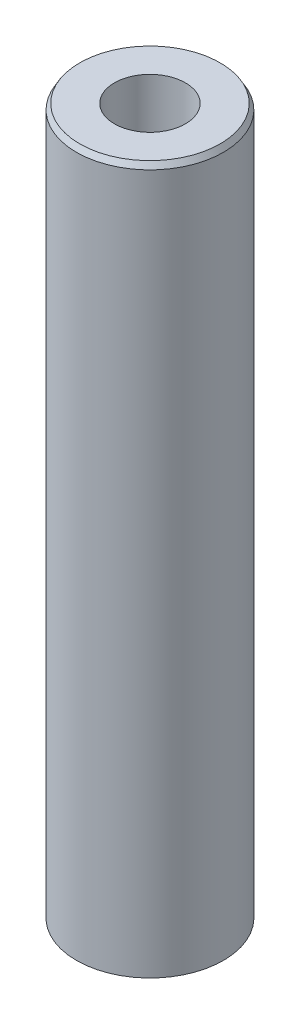
ISO-10303-21;
HEADER;
FILE_DESCRIPTION(('STEP AP214'),'2;1');
FILE_NAME('part.step','',(''),(''),'','','');
FILE_SCHEMA(('AUTOMOTIVE_DESIGN { 1 0 10303 214 1 1 1 1 }'));
ENDSEC;
DATA;
#1=APPLICATION_CONTEXT('core data for automotive mechanical design processes');
#2=APPLICATION_PROTOCOL_DEFINITION('international standard','automotive_design',2000,#1);
#3=PRODUCT_CONTEXT('',#1,'mechanical');
#4=PRODUCT('Part','Part','',(#3));
#5=PRODUCT_RELATED_PRODUCT_CATEGORY('part','',(#4));
#6=PRODUCT_DEFINITION_FORMATION('','',#4);
#7=PRODUCT_DEFINITION_CONTEXT('part definition',#1,'design');
#8=PRODUCT_DEFINITION('design','',#6,#7);
#9=PRODUCT_DEFINITION_SHAPE('','',#8);
#10=(LENGTH_UNIT() NAMED_UNIT(*) SI_UNIT(.MILLI.,.METRE.));
#11=(NAMED_UNIT(*) PLANE_ANGLE_UNIT() SI_UNIT($,.RADIAN.));
#12=(NAMED_UNIT(*) SI_UNIT($,.STERADIAN.) SOLID_ANGLE_UNIT());
#13=UNCERTAINTY_MEASURE_WITH_UNIT(LENGTH_MEASURE(1.E-05),#10,'distance_accuracy_value','');
#14=(GEOMETRIC_REPRESENTATION_CONTEXT(3) GLOBAL_UNCERTAINTY_ASSIGNED_CONTEXT((#13)) GLOBAL_UNIT_ASSIGNED_CONTEXT((#10,
#11,#12)) REPRESENTATION_CONTEXT('',''));
#15=CARTESIAN_POINT('',(0.,0.,0.));
#16=DIRECTION('',(0.,0.,1.));
#17=DIRECTION('',(1.,0.,0.));
#18=AXIS2_PLACEMENT_3D('',#15,#16,#17);
#19=CARTESIAN_POINT('',(0.,578.592608691516,0.));
#20=DIRECTION('',(0.,-1.,0.));
#21=DIRECTION('',(0.,0.,-1.));
#22=AXIS2_PLACEMENT_3D('',#19,#20,#21);
#23=CYLINDRICAL_SURFACE('',#22,60.);
#24=CARTESIAN_POINT('',(0.,573.949733634007,0.));
#25=DIRECTION('',(0.,1.,0.));
#26=DIRECTION('',(0.,0.,1.));
#27=AXIS2_PLACEMENT_3D('',#24,#25,#26);
#28=CIRCLE('',#27,60.);
#29=CARTESIAN_POINT('',(0.,573.949733634007,60.));
#30=VERTEX_POINT('',#29);
#31=EDGE_CURVE('E50',#30,#30,#28,.F.);
#32=ORIENTED_EDGE('',*,*,#31,.T.);
#33=EDGE_LOOP('',(#32));
#34=FACE_BOUND('',#33,.T.);
#35=CARTESIAN_POINT('',(0.,2.68056516426673,0.));
#36=DIRECTION('',(0.,1.,0.));
#37=DIRECTION('',(0.,0.,1.));
#38=AXIS2_PLACEMENT_3D('',#35,#36,#37);
#39=CIRCLE('',#38,60.);
#40=CARTESIAN_POINT('',(0.,2.68056516426673,60.));
#41=VERTEX_POINT('',#40);
#42=EDGE_CURVE('E51',#41,#41,#39,.T.);
#43=ORIENTED_EDGE('',*,*,#42,.T.);
#44=EDGE_LOOP('',(#43));
#45=FACE_BOUND('',#44,.T.);
#46=ADVANCED_FACE('F39',(#34,#45),#23,.T.);
#47=CARTESIAN_POINT('',(0.,578.592608691516,0.));
#48=DIRECTION('',(0.,1.,0.));
#49=DIRECTION('',(0.,0.,1.));
#50=AXIS2_PLACEMENT_3D('',#47,#48,#49);
#51=PLANE('',#50);
#52=CARTESIAN_POINT('',(0.,578.592608691516,0.));
#53=DIRECTION('',(0.,1.,0.));
#54=DIRECTION('',(0.,0.,1.));
#55=AXIS2_PLACEMENT_3D('',#52,#53,#54);
#56=CIRCLE('',#55,57.3194348357333);
#57=CARTESIAN_POINT('',(0.,578.592608691516,57.3194348357333));
#58=VERTEX_POINT('',#57);
#59=EDGE_CURVE('E54',#58,#58,#56,.T.);
#60=ORIENTED_EDGE('',*,*,#59,.T.);
#61=EDGE_LOOP('',(#60));
#62=FACE_BOUND('',#61,.T.);
#63=CARTESIAN_POINT('',(0.,578.592608691516,0.));
#64=DIRECTION('',(0.,1.,0.));
#65=DIRECTION('',(0.,0.,1.));
#66=AXIS2_PLACEMENT_3D('',#63,#64,#65);
#67=CIRCLE('',#66,28.9984251957055);
#68=CARTESIAN_POINT('',(0.,578.592608691516,28.9984251957055));
#69=VERTEX_POINT('',#68);
#70=EDGE_CURVE('E58',#69,#69,#67,.T.);
#71=ORIENTED_EDGE('',*,*,#70,.F.);
#72=EDGE_LOOP('',(#71));
#73=FACE_BOUND('',#72,.T.);
#74=ADVANCED_FACE('F69',(#62,#73),#51,.T.);
#75=CARTESIAN_POINT('',(0.,0.,0.));
#76=DIRECTION('',(0.,1.,0.));
#77=DIRECTION('',(0.,0.,1.));
#78=AXIS2_PLACEMENT_3D('',#75,#76,#77);
#79=PLANE('',#78);
#80=CARTESIAN_POINT('',(0.,0.,0.));
#81=DIRECTION('',(0.,1.,0.));
#82=DIRECTION('',(0.,0.,1.));
#83=AXIS2_PLACEMENT_3D('',#80,#81,#82);
#84=CIRCLE('',#83,55.3571249424906);
#85=CARTESIAN_POINT('',(0.,0.,55.3571249424906));
#86=VERTEX_POINT('',#85);
#87=EDGE_CURVE('E10',#86,#86,#84,.F.);
#88=ORIENTED_EDGE('',*,*,#87,.T.);
#89=EDGE_LOOP('',(#88));
#90=FACE_BOUND('',#89,.T.);
#91=CARTESIAN_POINT('',(0.,0.,0.));
#92=DIRECTION('',(0.,1.,0.));
#93=DIRECTION('',(0.,0.,1.));
#94=AXIS2_PLACEMENT_3D('',#91,#92,#93);
#95=CIRCLE('',#94,28.9984251957055);
#96=CARTESIAN_POINT('',(0.,0.,28.9984251957055));
#97=VERTEX_POINT('',#96);
#98=EDGE_CURVE('E63',#97,#97,#95,.T.);
#99=ORIENTED_EDGE('',*,*,#98,.T.);
#100=EDGE_LOOP('',(#99));
#101=FACE_BOUND('',#100,.T.);
#102=ADVANCED_FACE('F75',(#90,#101),#79,.F.);
#103=CARTESIAN_POINT('',(0.,578.592608691516,0.));
#104=DIRECTION('',(0.,-1.,0.));
#105=DIRECTION('',(0.,0.,-1.));
#106=AXIS2_PLACEMENT_3D('',#103,#104,#105);
#107=CYLINDRICAL_SURFACE('',#106,28.9984251957055);
#108=ORIENTED_EDGE('',*,*,#70,.T.);
#109=EDGE_LOOP('',(#108));
#110=FACE_BOUND('',#109,.T.);
#111=ORIENTED_EDGE('',*,*,#98,.F.);
#112=EDGE_LOOP('',(#111));
#113=FACE_BOUND('',#112,.T.);
#114=ADVANCED_FACE('F70',(#110,#113),#107,.F.);
#115=CARTESIAN_POINT('',(0.,578.592608691516,0.));
#116=DIRECTION('',(0.,-1.,0.));
#117=DIRECTION('',(0.,0.,-1.));
#118=AXIS2_PLACEMENT_3D('',#115,#116,#117);
#119=CONICAL_SURFACE('',#118,57.3194348357333,0.523598775598293);
#120=ORIENTED_EDGE('',*,*,#31,.F.);
#121=EDGE_LOOP('',(#120));
#122=FACE_BOUND('',#121,.T.);
#123=ORIENTED_EDGE('',*,*,#59,.F.);
#124=EDGE_LOOP('',(#123));
#125=FACE_BOUND('',#124,.T.);
#126=ADVANCED_FACE('F81',(#122,#125),#119,.T.);
#127=CARTESIAN_POINT('',(0.,2.68056516426673,0.));
#128=DIRECTION('',(0.,1.,0.));
#129=DIRECTION('',(0.,0.,1.));
#130=AXIS2_PLACEMENT_3D('',#127,#128,#129);
#131=CONICAL_SURFACE('',#130,60.,1.04719755119661);
#132=ORIENTED_EDGE('',*,*,#87,.F.);
#133=EDGE_LOOP('',(#132));
#134=FACE_BOUND('',#133,.T.);
#135=ORIENTED_EDGE('',*,*,#42,.F.);
#136=EDGE_LOOP('',(#135));
#137=FACE_BOUND('',#136,.T.);
#138=ADVANCED_FACE('F45',(#134,#137),#131,.T.);
#139=CLOSED_SHELL('',(#46,#74,#102,#114,#126,#138));
#140=MANIFOLD_SOLID_BREP('B2',#139);
#141=ADVANCED_BREP_SHAPE_REPRESENTATION('',(#18,#140),#14);
#142=SHAPE_DEFINITION_REPRESENTATION(#9,#141);
ENDSEC;
END-ISO-10303-21;
